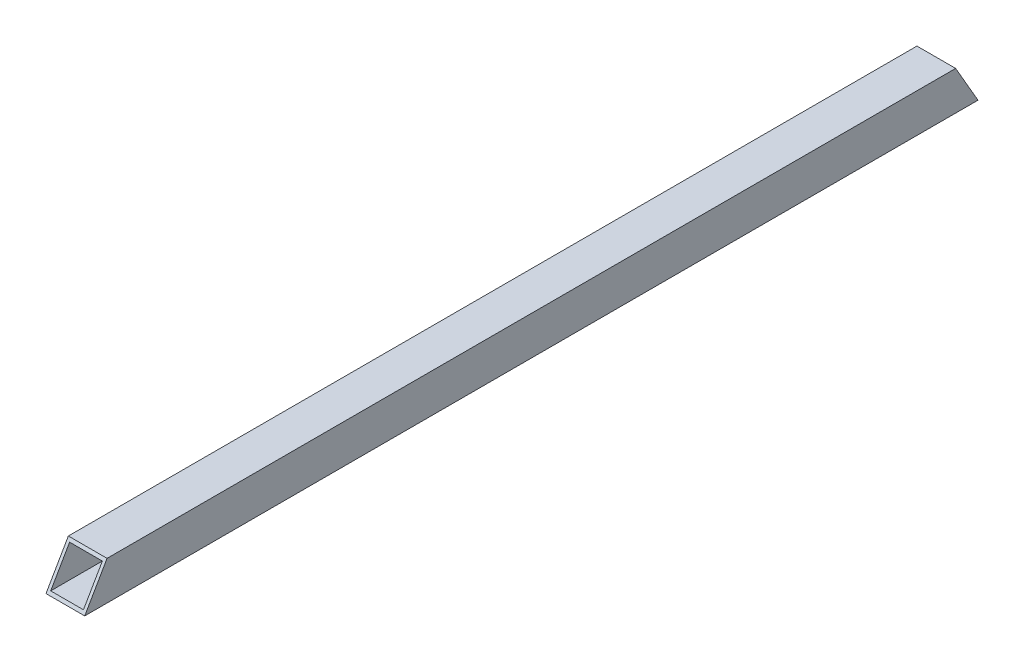
ISO-10303-21;
HEADER;
FILE_DESCRIPTION(('STEP AP214'),'2;1');
FILE_NAME('part.step','',(''),(''),'','','');
FILE_SCHEMA(('AUTOMOTIVE_DESIGN { 1 0 10303 214 1 1 1 1 }'));
ENDSEC;
DATA;
#1=APPLICATION_CONTEXT('core data for automotive mechanical design processes');
#2=APPLICATION_PROTOCOL_DEFINITION('international standard','automotive_design',2000,#1);
#3=PRODUCT_CONTEXT('',#1,'mechanical');
#4=PRODUCT('Part','Part','',(#3));
#5=PRODUCT_RELATED_PRODUCT_CATEGORY('part','',(#4));
#6=PRODUCT_DEFINITION_FORMATION('','',#4);
#7=PRODUCT_DEFINITION_CONTEXT('part definition',#1,'design');
#8=PRODUCT_DEFINITION('design','',#6,#7);
#9=PRODUCT_DEFINITION_SHAPE('','',#8);
#10=(LENGTH_UNIT() NAMED_UNIT(*) SI_UNIT(.MILLI.,.METRE.));
#11=(NAMED_UNIT(*) PLANE_ANGLE_UNIT() SI_UNIT($,.RADIAN.));
#12=(NAMED_UNIT(*) SI_UNIT($,.STERADIAN.) SOLID_ANGLE_UNIT());
#13=UNCERTAINTY_MEASURE_WITH_UNIT(LENGTH_MEASURE(1.E-05),#10,'distance_accuracy_value','');
#14=(GEOMETRIC_REPRESENTATION_CONTEXT(3) GLOBAL_UNCERTAINTY_ASSIGNED_CONTEXT((#13)) GLOBAL_UNIT_ASSIGNED_CONTEXT((#10,
#11,#12)) REPRESENTATION_CONTEXT('',''));
#15=CARTESIAN_POINT('',(0.,0.,0.));
#16=DIRECTION('',(0.,0.,1.));
#17=DIRECTION('',(1.,0.,0.));
#18=AXIS2_PLACEMENT_3D('',#15,#16,#17);
#19=CARTESIAN_POINT('',(-6.5,6.5,300.));
#20=DIRECTION('',(1.,0.,0.));
#21=DIRECTION('',(0.,1.,0.));
#22=AXIS2_PLACEMENT_3D('',#19,#20,#21);
#23=PLANE('',#22);
#24=DIRECTION('',(0.,0.,-1.));
#25=VECTOR('',#24,1.);
#26=CARTESIAN_POINT('',(-6.5,6.5,300.));
#27=LINE('',#26,#25);
#28=CARTESIAN_POINT('',(-6.4999999999999,6.5,292.494446500535));
#29=VERTEX_POINT('',#28);
#30=CARTESIAN_POINT('',(-6.5,6.5,7.50555349946525));
#31=VERTEX_POINT('',#30);
#32=EDGE_CURVE('E130',#29,#31,#27,.T.);
#33=ORIENTED_EDGE('',*,*,#32,.T.);
#34=DIRECTION('',(0.,-0.866025403784435,-0.500000000000006));
#35=VECTOR('',#34,1.);
#36=CARTESIAN_POINT('',(-6.50000000000002,133.153810567667,80.6291651246005));
#37=LINE('',#36,#35);
#38=CARTESIAN_POINT('',(-6.4999999999999,-6.5,0.));
#39=VERTEX_POINT('',#38);
#40=EDGE_CURVE('E54',#31,#39,#37,.T.);
#41=ORIENTED_EDGE('',*,*,#40,.T.);
#42=DIRECTION('',(0.,0.,-1.));
#43=VECTOR('',#42,1.);
#44=CARTESIAN_POINT('',(-6.5,-6.5,300.));
#45=LINE('',#44,#43);
#46=CARTESIAN_POINT('',(-6.4999999999999,-6.5,300.));
#47=VERTEX_POINT('',#46);
#48=EDGE_CURVE('E134',#47,#39,#45,.T.);
#49=ORIENTED_EDGE('',*,*,#48,.F.);
#50=DIRECTION('',(0.,0.866025403784437,-0.500000000000003));
#51=VECTOR('',#50,1.);
#52=CARTESIAN_POINT('',(-6.5,3.24999999999997,294.370834875401));
#53=LINE('',#52,#51);
#54=EDGE_CURVE('E164',#47,#29,#53,.T.);
#55=ORIENTED_EDGE('',*,*,#54,.T.);
#56=EDGE_LOOP('',(#33,#41,#49,#55));
#57=FACE_BOUND('',#56,.T.);
#58=ADVANCED_FACE('F39',(#57),#23,.F.);
#59=CARTESIAN_POINT('',(-6.5,-6.5,300.));
#60=DIRECTION('',(0.,1.,0.));
#61=DIRECTION('',(-1.,0.,0.));
#62=AXIS2_PLACEMENT_3D('',#59,#60,#61);
#63=PLANE('',#62);
#64=DIRECTION('',(1.,0.,0.));
#65=VECTOR('',#64,1.);
#66=CARTESIAN_POINT('',(-6.5,-6.5,0.));
#67=LINE('',#66,#65);
#68=CARTESIAN_POINT('',(6.50000000000012,-6.5,0.));
#69=VERTEX_POINT('',#68);
#70=EDGE_CURVE('E180',#39,#69,#67,.T.);
#71=ORIENTED_EDGE('',*,*,#70,.T.);
#72=DIRECTION('',(0.,0.,-1.));
#73=VECTOR('',#72,1.);
#74=CARTESIAN_POINT('',(6.5,-6.5,300.));
#75=LINE('',#74,#73);
#76=CARTESIAN_POINT('',(6.50000000000012,-6.5,300.));
#77=VERTEX_POINT('',#76);
#78=EDGE_CURVE('E122',#77,#69,#75,.T.);
#79=ORIENTED_EDGE('',*,*,#78,.F.);
#80=DIRECTION('',(1.,0.,0.));
#81=VECTOR('',#80,1.);
#82=CARTESIAN_POINT('',(-6.5,-6.5,300.));
#83=LINE('',#82,#81);
#84=EDGE_CURVE('E136',#47,#77,#83,.T.);
#85=ORIENTED_EDGE('',*,*,#84,.F.);
#86=ORIENTED_EDGE('',*,*,#48,.T.);
#87=EDGE_LOOP('',(#71,#79,#85,#86));
#88=FACE_BOUND('',#87,.T.);
#89=ADVANCED_FACE('F184',(#88),#63,.F.);
#90=CARTESIAN_POINT('',(6.5,6.5,300.));
#91=DIRECTION('',(-1.,0.,0.));
#92=DIRECTION('',(0.,-1.,0.));
#93=AXIS2_PLACEMENT_3D('',#90,#91,#92);
#94=PLANE('',#93);
#95=ORIENTED_EDGE('',*,*,#78,.T.);
#96=DIRECTION('',(0.,0.866025403784435,0.500000000000006));
#97=VECTOR('',#96,1.);
#98=CARTESIAN_POINT('',(6.49999999999997,133.153810567667,80.6291651246005));
#99=LINE('',#98,#97);
#100=CARTESIAN_POINT('',(6.50000000000012,6.5,7.50555349946525));
#101=VERTEX_POINT('',#100);
#102=EDGE_CURVE('E106',#69,#101,#99,.T.);
#103=ORIENTED_EDGE('',*,*,#102,.T.);
#104=DIRECTION('',(0.,0.,-1.));
#105=VECTOR('',#104,1.);
#106=CARTESIAN_POINT('',(6.5,6.5,300.));
#107=LINE('',#106,#105);
#108=CARTESIAN_POINT('',(6.5,6.5,292.494446500535));
#109=VERTEX_POINT('',#108);
#110=EDGE_CURVE('E120',#109,#101,#107,.T.);
#111=ORIENTED_EDGE('',*,*,#110,.F.);
#112=DIRECTION('',(0.,-0.866025403784437,0.500000000000003));
#113=VECTOR('',#112,1.);
#114=CARTESIAN_POINT('',(6.5,3.24999999999997,294.370834875401));
#115=LINE('',#114,#113);
#116=EDGE_CURVE('E171',#109,#77,#115,.T.);
#117=ORIENTED_EDGE('',*,*,#116,.T.);
#118=EDGE_LOOP('',(#95,#103,#111,#117));
#119=FACE_BOUND('',#118,.T.);
#120=ADVANCED_FACE('F118',(#119),#94,.F.);
#121=CARTESIAN_POINT('',(-6.5,6.5,300.));
#122=DIRECTION('',(0.,-1.,0.));
#123=DIRECTION('',(0.,0.,-1.));
#124=AXIS2_PLACEMENT_3D('',#121,#122,#123);
#125=PLANE('',#124);
#126=ORIENTED_EDGE('',*,*,#110,.T.);
#127=DIRECTION('',(-1.,0.,0.));
#128=VECTOR('',#127,1.);
#129=CARTESIAN_POINT('',(398.453506770964,6.50000000000008,7.50555349946525));
#130=LINE('',#129,#128);
#131=EDGE_CURVE('E103',#101,#31,#130,.T.);
#132=ORIENTED_EDGE('',*,*,#131,.T.);
#133=ORIENTED_EDGE('',*,*,#32,.F.);
#134=DIRECTION('',(-1.,0.,0.));
#135=VECTOR('',#134,1.);
#136=CARTESIAN_POINT('',(398.453506770964,6.50000000000008,292.494446500535));
#137=LINE('',#136,#135);
#138=EDGE_CURVE('E128',#109,#29,#137,.T.);
#139=ORIENTED_EDGE('',*,*,#138,.F.);
#140=EDGE_LOOP('',(#126,#132,#133,#139));
#141=FACE_BOUND('',#140,.T.);
#142=ADVANCED_FACE('F127',(#141),#125,.F.);
#143=CARTESIAN_POINT('',(5.5,5.5,300.));
#144=DIRECTION('',(-1.,0.,0.));
#145=DIRECTION('',(0.,-1.,0.));
#146=AXIS2_PLACEMENT_3D('',#143,#144,#145);
#147=PLANE('',#146);
#148=DIRECTION('',(0.,0.866025403784435,0.500000000000006));
#149=VECTOR('',#148,1.);
#150=CARTESIAN_POINT('',(5.49999999999998,132.403810567667,80.1961524227083));
#151=LINE('',#150,#149);
#152=CARTESIAN_POINT('',(5.5,-5.5,0.577350269189646));
#153=VERTEX_POINT('',#152);
#154=CARTESIAN_POINT('',(5.5,5.5,6.9282032302756));
#155=VERTEX_POINT('',#154);
#156=EDGE_CURVE('E124',#153,#155,#151,.T.);
#157=ORIENTED_EDGE('',*,*,#156,.F.);
#158=DIRECTION('',(0.,0.,-1.));
#159=VECTOR('',#158,1.);
#160=CARTESIAN_POINT('',(5.5,-5.5,300.));
#161=LINE('',#160,#159);
#162=CARTESIAN_POINT('',(5.5,-5.5,299.42264973081));
#163=VERTEX_POINT('',#162);
#164=EDGE_CURVE('E156',#163,#153,#161,.T.);
#165=ORIENTED_EDGE('',*,*,#164,.F.);
#166=DIRECTION('',(0.,-0.866025403784437,0.500000000000003));
#167=VECTOR('',#166,1.);
#168=CARTESIAN_POINT('',(5.5,2.49999999999997,294.803847577293));
#169=LINE('',#168,#167);
#170=CARTESIAN_POINT('',(5.5,5.5,293.071796769724));
#171=VERTEX_POINT('',#170);
#172=EDGE_CURVE('E152',#171,#163,#169,.T.);
#173=ORIENTED_EDGE('',*,*,#172,.F.);
#174=DIRECTION('',(0.,0.,-1.));
#175=VECTOR('',#174,1.);
#176=CARTESIAN_POINT('',(5.5,5.5,300.));
#177=LINE('',#176,#175);
#178=EDGE_CURVE('E177',#171,#155,#177,.T.);
#179=ORIENTED_EDGE('',*,*,#178,.T.);
#180=EDGE_LOOP('',(#157,#165,#173,#179));
#181=FACE_BOUND('',#180,.T.);
#182=ADVANCED_FACE('F161',(#181),#147,.T.);
#183=CARTESIAN_POINT('',(-5.5,5.5,300.));
#184=DIRECTION('',(0.,-1.,0.));
#185=DIRECTION('',(0.,0.,-1.));
#186=AXIS2_PLACEMENT_3D('',#183,#184,#185);
#187=PLANE('',#186);
#188=DIRECTION('',(-1.,0.,0.));
#189=VECTOR('',#188,1.);
#190=CARTESIAN_POINT('',(-5.50000000000003,5.5,6.9282032302756));
#191=LINE('',#190,#189);
#192=CARTESIAN_POINT('',(-5.5,5.5,6.92820323027558));
#193=VERTEX_POINT('',#192);
#194=EDGE_CURVE('E62',#155,#193,#191,.T.);
#195=ORIENTED_EDGE('',*,*,#194,.F.);
#196=ORIENTED_EDGE('',*,*,#178,.F.);
#197=DIRECTION('',(1.,0.,0.));
#198=VECTOR('',#197,1.);
#199=CARTESIAN_POINT('',(-5.5,5.5,293.071796769724));
#200=LINE('',#199,#198);
#201=CARTESIAN_POINT('',(-5.5,5.5,293.071796769724));
#202=VERTEX_POINT('',#201);
#203=EDGE_CURVE('E196',#202,#171,#200,.T.);
#204=ORIENTED_EDGE('',*,*,#203,.F.);
#205=DIRECTION('',(0.,0.,-1.));
#206=VECTOR('',#205,1.);
#207=CARTESIAN_POINT('',(-5.5,5.5,300.));
#208=LINE('',#207,#206);
#209=EDGE_CURVE('E168',#202,#193,#208,.T.);
#210=ORIENTED_EDGE('',*,*,#209,.T.);
#211=EDGE_LOOP('',(#195,#196,#204,#210));
#212=FACE_BOUND('',#211,.T.);
#213=ADVANCED_FACE('F224',(#212),#187,.T.);
#214=CARTESIAN_POINT('',(-5.5,5.5,300.));
#215=DIRECTION('',(1.,0.,0.));
#216=DIRECTION('',(0.,1.,0.));
#217=AXIS2_PLACEMENT_3D('',#214,#215,#216);
#218=PLANE('',#217);
#219=DIRECTION('',(0.,-0.866025403784435,-0.500000000000006));
#220=VECTOR('',#219,1.);
#221=CARTESIAN_POINT('',(-5.50000000000002,132.403810567667,80.1961524227083));
#222=LINE('',#221,#220);
#223=CARTESIAN_POINT('',(-5.5,-5.5,0.577350269189647));
#224=VERTEX_POINT('',#223);
#225=EDGE_CURVE('E113',#193,#224,#222,.T.);
#226=ORIENTED_EDGE('',*,*,#225,.F.);
#227=ORIENTED_EDGE('',*,*,#209,.F.);
#228=DIRECTION('',(0.,0.866025403784437,-0.500000000000003));
#229=VECTOR('',#228,1.);
#230=CARTESIAN_POINT('',(-5.5,2.49999999999997,294.803847577293));
#231=LINE('',#230,#229);
#232=CARTESIAN_POINT('',(-5.5,-5.5,299.42264973081));
#233=VERTEX_POINT('',#232);
#234=EDGE_CURVE('E151',#233,#202,#231,.T.);
#235=ORIENTED_EDGE('',*,*,#234,.F.);
#236=DIRECTION('',(0.,0.,-1.));
#237=VECTOR('',#236,1.);
#238=CARTESIAN_POINT('',(-5.5,-5.5,300.));
#239=LINE('',#238,#237);
#240=EDGE_CURVE('E159',#233,#224,#239,.T.);
#241=ORIENTED_EDGE('',*,*,#240,.T.);
#242=EDGE_LOOP('',(#226,#227,#235,#241));
#243=FACE_BOUND('',#242,.T.);
#244=ADVANCED_FACE('F209',(#243),#218,.T.);
#245=CARTESIAN_POINT('',(-5.5,-5.5,300.));
#246=DIRECTION('',(0.,1.,0.));
#247=DIRECTION('',(0.,0.,1.));
#248=AXIS2_PLACEMENT_3D('',#245,#246,#247);
#249=PLANE('',#248);
#250=DIRECTION('',(1.,0.,0.));
#251=VECTOR('',#250,1.);
#252=CARTESIAN_POINT('',(-5.50000000000003,-5.5,0.577350269189647));
#253=LINE('',#252,#251);
#254=EDGE_CURVE('E11',#224,#153,#253,.T.);
#255=ORIENTED_EDGE('',*,*,#254,.F.);
#256=ORIENTED_EDGE('',*,*,#240,.F.);
#257=DIRECTION('',(-1.,0.,0.));
#258=VECTOR('',#257,1.);
#259=CARTESIAN_POINT('',(-5.5,-5.5,299.42264973081));
#260=LINE('',#259,#258);
#261=EDGE_CURVE('E47',#163,#233,#260,.T.);
#262=ORIENTED_EDGE('',*,*,#261,.F.);
#263=ORIENTED_EDGE('',*,*,#164,.T.);
#264=EDGE_LOOP('',(#255,#256,#262,#263));
#265=FACE_BOUND('',#264,.T.);
#266=ADVANCED_FACE('F155',(#265),#249,.T.);
#267=CARTESIAN_POINT('',(398.453506770964,6.50000000000008,292.494446500535));
#268=DIRECTION('',(0.,-0.500000000000003,-0.866025403784437));
#269=DIRECTION('',(0.,0.866025403784437,-0.500000000000003));
#270=AXIS2_PLACEMENT_3D('',#267,#268,#269);
#271=PLANE('',#270);
#272=ORIENTED_EDGE('',*,*,#203,.T.);
#273=ORIENTED_EDGE('',*,*,#172,.T.);
#274=ORIENTED_EDGE('',*,*,#261,.T.);
#275=ORIENTED_EDGE('',*,*,#234,.T.);
#276=EDGE_LOOP('',(#272,#273,#274,#275));
#277=FACE_BOUND('',#276,.T.);
#278=ORIENTED_EDGE('',*,*,#54,.F.);
#279=ORIENTED_EDGE('',*,*,#84,.T.);
#280=ORIENTED_EDGE('',*,*,#116,.F.);
#281=ORIENTED_EDGE('',*,*,#138,.T.);
#282=EDGE_LOOP('',(#278,#279,#280,#281));
#283=FACE_BOUND('',#282,.T.);
#284=ADVANCED_FACE('F148',(#277,#283),#271,.F.);
#285=CARTESIAN_POINT('',(398.453506770964,-6.49999999999992,0.));
#286=DIRECTION('',(0.,-0.500000000000006,0.866025403784435));
#287=DIRECTION('',(0.,-0.866025403784435,-0.500000000000006));
#288=AXIS2_PLACEMENT_3D('',#285,#286,#287);
#289=PLANE('',#288);
#290=ORIENTED_EDGE('',*,*,#254,.T.);
#291=ORIENTED_EDGE('',*,*,#156,.T.);
#292=ORIENTED_EDGE('',*,*,#194,.T.);
#293=ORIENTED_EDGE('',*,*,#225,.T.);
#294=EDGE_LOOP('',(#290,#291,#292,#293));
#295=FACE_BOUND('',#294,.T.);
#296=ORIENTED_EDGE('',*,*,#40,.F.);
#297=ORIENTED_EDGE('',*,*,#131,.F.);
#298=ORIENTED_EDGE('',*,*,#102,.F.);
#299=ORIENTED_EDGE('',*,*,#70,.F.);
#300=EDGE_LOOP('',(#296,#297,#298,#299));
#301=FACE_BOUND('',#300,.T.);
#302=ADVANCED_FACE('F105',(#295,#301),#289,.F.);
#303=CLOSED_SHELL('',(#58,#89,#120,#142,#182,#213,#244,#266,#284,#302));
#304=MANIFOLD_SOLID_BREP('B2',#303);
#305=ADVANCED_BREP_SHAPE_REPRESENTATION('',(#18,#304),#14);
#306=SHAPE_DEFINITION_REPRESENTATION(#9,#305);
ENDSEC;
END-ISO-10303-21;
